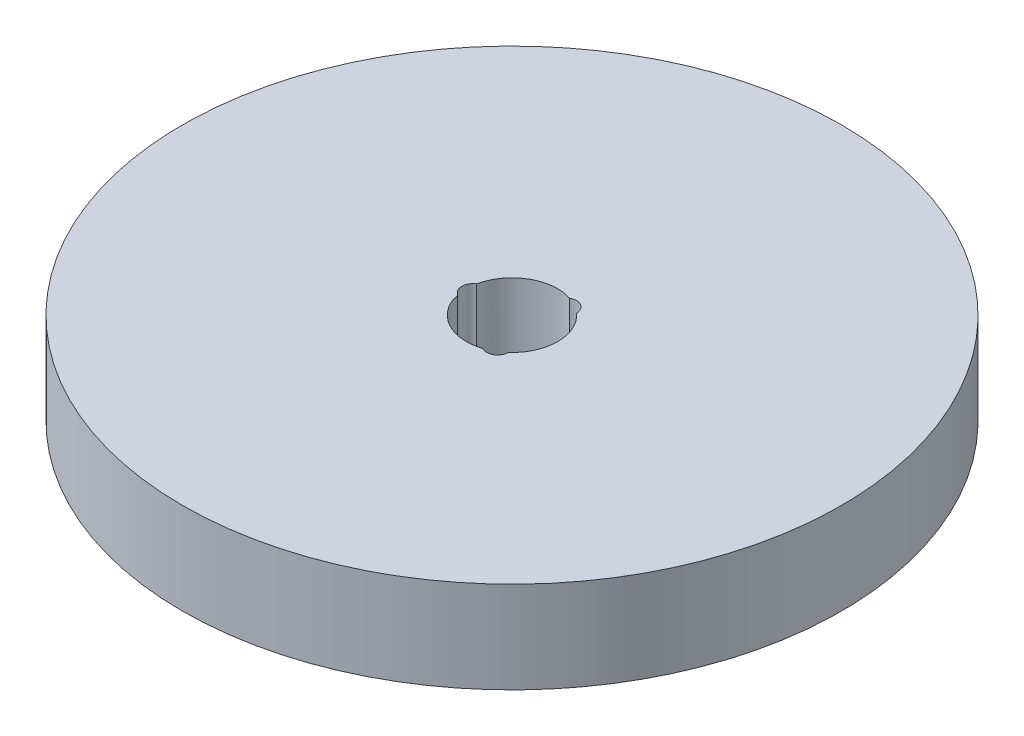
ISO-10303-21;
HEADER;
FILE_DESCRIPTION(('STEP AP214'),'2;1');
FILE_NAME('part.step','',(''),(''),'','','');
FILE_SCHEMA(('AUTOMOTIVE_DESIGN { 1 0 10303 214 1 1 1 1 }'));
ENDSEC;
DATA;
#1=APPLICATION_CONTEXT('core data for automotive mechanical design processes');
#2=APPLICATION_PROTOCOL_DEFINITION('international standard','automotive_design',2000,#1);
#3=PRODUCT_CONTEXT('',#1,'mechanical');
#4=PRODUCT('Part','Part','',(#3));
#5=PRODUCT_RELATED_PRODUCT_CATEGORY('part','',(#4));
#6=PRODUCT_DEFINITION_FORMATION('','',#4);
#7=PRODUCT_DEFINITION_CONTEXT('part definition',#1,'design');
#8=PRODUCT_DEFINITION('design','',#6,#7);
#9=PRODUCT_DEFINITION_SHAPE('','',#8);
#10=(LENGTH_UNIT() NAMED_UNIT(*) SI_UNIT(.MILLI.,.METRE.));
#11=(NAMED_UNIT(*) PLANE_ANGLE_UNIT() SI_UNIT($,.RADIAN.));
#12=(NAMED_UNIT(*) SI_UNIT($,.STERADIAN.) SOLID_ANGLE_UNIT());
#13=UNCERTAINTY_MEASURE_WITH_UNIT(LENGTH_MEASURE(1.E-05),#10,'distance_accuracy_value','');
#14=(GEOMETRIC_REPRESENTATION_CONTEXT(3) GLOBAL_UNCERTAINTY_ASSIGNED_CONTEXT((#13)) GLOBAL_UNIT_ASSIGNED_CONTEXT((#10,
#11,#12)) REPRESENTATION_CONTEXT('',''));
#15=CARTESIAN_POINT('',(0.,0.,0.));
#16=DIRECTION('',(0.,0.,1.));
#17=DIRECTION('',(1.,0.,0.));
#18=AXIS2_PLACEMENT_3D('',#15,#16,#17);
#19=CARTESIAN_POINT('',(0.,25.,0.));
#20=DIRECTION('',(0.,-1.,0.));
#21=DIRECTION('',(0.,0.,-1.));
#22=AXIS2_PLACEMENT_3D('',#19,#20,#21);
#23=CYLINDRICAL_SURFACE('',#22,90.);
#24=CARTESIAN_POINT('',(0.,25.,0.));
#25=DIRECTION('',(0.,1.,0.));
#26=DIRECTION('',(0.,0.,1.));
#27=AXIS2_PLACEMENT_3D('',#24,#25,#26);
#28=CIRCLE('',#27,90.);
#29=CARTESIAN_POINT('',(0.,25.,90.));
#30=VERTEX_POINT('',#29);
#31=EDGE_CURVE('E130',#30,#30,#28,.T.);
#32=ORIENTED_EDGE('',*,*,#31,.F.);
#33=EDGE_LOOP('',(#32));
#34=FACE_BOUND('',#33,.T.);
#35=CARTESIAN_POINT('',(0.,0.,0.));
#36=DIRECTION('',(0.,1.,0.));
#37=DIRECTION('',(0.,0.,1.));
#38=AXIS2_PLACEMENT_3D('',#35,#36,#37);
#39=CIRCLE('',#38,90.);
#40=CARTESIAN_POINT('',(0.,0.,90.));
#41=VERTEX_POINT('',#40);
#42=EDGE_CURVE('E117',#41,#41,#39,.T.);
#43=ORIENTED_EDGE('',*,*,#42,.T.);
#44=EDGE_LOOP('',(#43));
#45=FACE_BOUND('',#44,.T.);
#46=ADVANCED_FACE('F39',(#34,#45),#23,.T.);
#47=CARTESIAN_POINT('',(0.,25.,0.));
#48=DIRECTION('',(0.,1.,0.));
#49=DIRECTION('',(0.,0.,1.));
#50=AXIS2_PLACEMENT_3D('',#47,#48,#49);
#51=PLANE('',#50);
#52=CARTESIAN_POINT('',(5.32564066163358,25.,9.22428020880399));
#53=DIRECTION('',(0.,1.,0.));
#54=DIRECTION('',(0.866025403784436,0.,-0.500000000000004));
#55=AXIS2_PLACEMENT_3D('',#52,#53,#54);
#56=CIRCLE('',#55,3.03611618113724);
#57=CARTESIAN_POINT('',(3.86672240554045,25.,11.8869027857761));
#58=VERTEX_POINT('',#57);
#59=CARTESIAN_POINT('',(8.36099858202797,25.,9.29213122546848));
#60=VERTEX_POINT('',#59);
#61=EDGE_CURVE('E148',#58,#60,#56,.T.);
#62=ORIENTED_EDGE('',*,*,#61,.F.);
#63=CARTESIAN_POINT('',(0.,25.,0.));
#64=DIRECTION('',(0.,1.,0.));
#65=DIRECTION('',(0.,0.,1.));
#66=AXIS2_PLACEMENT_3D('',#63,#64,#65);
#67=CIRCLE('',#66,12.5);
#68=CARTESIAN_POINT('',(-12.2277209875683,25.,2.5947715603076));
#69=VERTEX_POINT('',#68);
#70=EDGE_CURVE('E113',#69,#58,#67,.T.);
#71=ORIENTED_EDGE('',*,*,#70,.F.);
#72=CARTESIAN_POINT('',(-10.6512813232671,25.,0.));
#73=DIRECTION('',(0.,1.,0.));
#74=DIRECTION('',(0.,0.,1.));
#75=AXIS2_PLACEMENT_3D('',#72,#73,#74);
#76=CIRCLE('',#75,3.03611618113724);
#77=CARTESIAN_POINT('',(-12.2277209875683,25.,-2.5947715603076));
#78=VERTEX_POINT('',#77);
#79=EDGE_CURVE('E125',#78,#69,#76,.T.);
#80=ORIENTED_EDGE('',*,*,#79,.F.);
#81=CARTESIAN_POINT('',(3.86672240554029,25.,-11.8869027857761));
#82=VERTEX_POINT('',#81);
#83=EDGE_CURVE('E107',#82,#78,#67,.T.);
#84=ORIENTED_EDGE('',*,*,#83,.F.);
#85=CARTESIAN_POINT('',(5.32564066163345,25.,-9.22428020880406));
#86=DIRECTION('',(0.,1.,0.));
#87=DIRECTION('',(-0.866025403784443,0.,-0.499999999999992));
#88=AXIS2_PLACEMENT_3D('',#85,#86,#87);
#89=CIRCLE('',#88,3.03611618113724);
#90=CARTESIAN_POINT('',(8.36099858202784,25.,-9.29213122546859));
#91=VERTEX_POINT('',#90);
#92=EDGE_CURVE('E95',#91,#82,#89,.T.);
#93=ORIENTED_EDGE('',*,*,#92,.F.);
#94=EDGE_CURVE('E106',#60,#91,#67,.T.);
#95=ORIENTED_EDGE('',*,*,#94,.F.);
#96=EDGE_LOOP('',(#62,#71,#80,#84,#93,#95));
#97=FACE_BOUND('',#96,.T.);
#98=ORIENTED_EDGE('',*,*,#31,.T.);
#99=EDGE_LOOP('',(#98));
#100=FACE_BOUND('',#99,.T.);
#101=ADVANCED_FACE('F102',(#97,#100),#51,.T.);
#102=CARTESIAN_POINT('',(0.,0.,0.));
#103=DIRECTION('',(0.,1.,0.));
#104=DIRECTION('',(0.,0.,1.));
#105=AXIS2_PLACEMENT_3D('',#102,#103,#104);
#106=PLANE('',#105);
#107=CARTESIAN_POINT('',(0.,0.,0.));
#108=DIRECTION('',(0.,1.,0.));
#109=DIRECTION('',(0.,0.,1.));
#110=AXIS2_PLACEMENT_3D('',#107,#108,#109);
#111=CIRCLE('',#110,12.5);
#112=CARTESIAN_POINT('',(0.,0.,12.5));
#113=VERTEX_POINT('',#112);
#114=EDGE_CURVE('E118',#113,#113,#111,.T.);
#115=ORIENTED_EDGE('',*,*,#114,.T.);
#116=EDGE_LOOP('',(#115));
#117=FACE_BOUND('',#116,.T.);
#118=ORIENTED_EDGE('',*,*,#42,.F.);
#119=EDGE_LOOP('',(#118));
#120=FACE_BOUND('',#119,.T.);
#121=ADVANCED_FACE('F161',(#117,#120),#106,.F.);
#122=CARTESIAN_POINT('',(0.,25.,0.));
#123=DIRECTION('',(0.,-1.,0.));
#124=DIRECTION('',(0.,0.,-1.));
#125=AXIS2_PLACEMENT_3D('',#122,#123,#124);
#126=CYLINDRICAL_SURFACE('',#125,12.5);
#127=DIRECTION('',(0.,1.,0.));
#128=VECTOR('',#127,1.);
#129=CARTESIAN_POINT('',(3.86672240554045,13.1831182027696,11.8869027857761));
#130=LINE('',#129,#128);
#131=CARTESIAN_POINT('',(3.86672240554045,1.36623640553924,11.8869027857761));
#132=VERTEX_POINT('',#131);
#133=EDGE_CURVE('E11',#132,#58,#130,.T.);
#134=ORIENTED_EDGE('',*,*,#133,.F.);
#135=CARTESIAN_POINT('',(0.,1.36623640553924,0.));
#136=DIRECTION('',(0.,1.,0.));
#137=DIRECTION('',(0.,0.,1.));
#138=AXIS2_PLACEMENT_3D('',#135,#136,#137);
#139=CIRCLE('',#138,12.5);
#140=CARTESIAN_POINT('',(8.36099858202797,1.36623640553924,9.29213122546848));
#141=VERTEX_POINT('',#140);
#142=EDGE_CURVE('E100',#132,#141,#139,.T.);
#143=ORIENTED_EDGE('',*,*,#142,.T.);
#144=DIRECTION('',(0.,1.,0.));
#145=VECTOR('',#144,1.);
#146=CARTESIAN_POINT('',(8.36099858202797,13.1831182027696,9.29213122546847));
#147=LINE('',#146,#145);
#148=EDGE_CURVE('E46',#60,#141,#147,.F.);
#149=ORIENTED_EDGE('',*,*,#148,.F.);
#150=ORIENTED_EDGE('',*,*,#94,.T.);
#151=DIRECTION('',(0.,1.,0.));
#152=VECTOR('',#151,1.);
#153=CARTESIAN_POINT('',(8.36099858202784,13.1831182027696,-9.29213122546859));
#154=LINE('',#153,#152);
#155=CARTESIAN_POINT('',(8.36099858202784,1.36623640553924,-9.29213122546859));
#156=VERTEX_POINT('',#155);
#157=EDGE_CURVE('E90',#156,#91,#154,.T.);
#158=ORIENTED_EDGE('',*,*,#157,.F.);
#159=CARTESIAN_POINT('',(0.,1.36623640553924,0.));
#160=DIRECTION('',(0.,1.,0.));
#161=DIRECTION('',(0.,0.,1.));
#162=AXIS2_PLACEMENT_3D('',#159,#160,#161);
#163=CIRCLE('',#162,12.5);
#164=CARTESIAN_POINT('',(3.86672240554029,1.36623640553924,-11.8869027857761));
#165=VERTEX_POINT('',#164);
#166=EDGE_CURVE('E143',#156,#165,#163,.T.);
#167=ORIENTED_EDGE('',*,*,#166,.T.);
#168=DIRECTION('',(0.,1.,0.));
#169=VECTOR('',#168,1.);
#170=CARTESIAN_POINT('',(3.86672240554028,13.1831182027696,-11.8869027857761));
#171=LINE('',#170,#169);
#172=EDGE_CURVE('E98',#82,#165,#171,.F.);
#173=ORIENTED_EDGE('',*,*,#172,.F.);
#174=ORIENTED_EDGE('',*,*,#83,.T.);
#175=DIRECTION('',(0.,1.,0.));
#176=VECTOR('',#175,1.);
#177=CARTESIAN_POINT('',(-12.2277209875683,13.1831182027696,-2.5947715603076));
#178=LINE('',#177,#176);
#179=CARTESIAN_POINT('',(-12.2277209875683,1.36623640553924,-2.5947715603076));
#180=VERTEX_POINT('',#179);
#181=EDGE_CURVE('E137',#180,#78,#178,.T.);
#182=ORIENTED_EDGE('',*,*,#181,.F.);
#183=CARTESIAN_POINT('',(0.,1.36623640553924,0.));
#184=DIRECTION('',(0.,1.,0.));
#185=DIRECTION('',(0.,0.,1.));
#186=AXIS2_PLACEMENT_3D('',#183,#184,#185);
#187=CIRCLE('',#186,12.5);
#188=CARTESIAN_POINT('',(-12.2277209875683,1.36623640553924,2.5947715603076));
#189=VERTEX_POINT('',#188);
#190=EDGE_CURVE('E128',#180,#189,#187,.T.);
#191=ORIENTED_EDGE('',*,*,#190,.T.);
#192=DIRECTION('',(0.,1.,0.));
#193=VECTOR('',#192,1.);
#194=CARTESIAN_POINT('',(-12.2277209875683,13.1831182027696,2.5947715603076));
#195=LINE('',#194,#193);
#196=EDGE_CURVE('E134',#69,#189,#195,.F.);
#197=ORIENTED_EDGE('',*,*,#196,.F.);
#198=ORIENTED_EDGE('',*,*,#70,.T.);
#199=EDGE_LOOP('',(#134,#143,#149,#150,#158,#167,#173,#174,#182,#191,#197,#198));
#200=FACE_BOUND('',#199,.T.);
#201=ORIENTED_EDGE('',*,*,#114,.F.);
#202=EDGE_LOOP('',(#201));
#203=FACE_BOUND('',#202,.T.);
#204=ADVANCED_FACE('F115',(#200,#203),#126,.F.);
#205=CARTESIAN_POINT('',(-10.6512813232671,1.36623640553924,0.));
#206=DIRECTION('',(0.,1.,0.));
#207=DIRECTION('',(0.,0.,1.));
#208=AXIS2_PLACEMENT_3D('',#205,#206,#207);
#209=CYLINDRICAL_SURFACE('',#208,3.03611618113724);
#210=ORIENTED_EDGE('',*,*,#181,.T.);
#211=ORIENTED_EDGE('',*,*,#79,.T.);
#212=ORIENTED_EDGE('',*,*,#196,.T.);
#213=CARTESIAN_POINT('',(-10.6512813232671,1.36623640553924,0.));
#214=DIRECTION('',(0.,1.,0.));
#215=DIRECTION('',(0.,0.,1.));
#216=AXIS2_PLACEMENT_3D('',#213,#214,#215);
#217=CIRCLE('',#216,3.03611618113724);
#218=EDGE_CURVE('E127',#180,#189,#217,.T.);
#219=ORIENTED_EDGE('',*,*,#218,.F.);
#220=EDGE_LOOP('',(#210,#211,#212,#219));
#221=FACE_BOUND('',#220,.T.);
#222=ADVANCED_FACE('F175',(#221),#209,.F.);
#223=CARTESIAN_POINT('',(-10.6512813232671,1.36623640553924,0.));
#224=DIRECTION('',(0.,1.,0.));
#225=DIRECTION('',(0.,0.,1.));
#226=AXIS2_PLACEMENT_3D('',#223,#224,#225);
#227=PLANE('',#226);
#228=ORIENTED_EDGE('',*,*,#218,.T.);
#229=ORIENTED_EDGE('',*,*,#190,.F.);
#230=EDGE_LOOP('',(#228,#229));
#231=FACE_BOUND('',#230,.T.);
#232=ADVANCED_FACE('F176',(#231),#227,.T.);
#233=CARTESIAN_POINT('',(5.32564066163345,1.36623640553924,-9.22428020880406));
#234=DIRECTION('',(0.,1.,0.));
#235=DIRECTION('',(0.,0.,1.));
#236=AXIS2_PLACEMENT_3D('',#233,#234,#235);
#237=CYLINDRICAL_SURFACE('',#236,3.03611618113724);
#238=ORIENTED_EDGE('',*,*,#157,.T.);
#239=ORIENTED_EDGE('',*,*,#92,.T.);
#240=ORIENTED_EDGE('',*,*,#172,.T.);
#241=CARTESIAN_POINT('',(5.32564066163345,1.36623640553924,-9.22428020880406));
#242=DIRECTION('',(0.,1.,0.));
#243=DIRECTION('',(-0.866025403784443,0.,-0.499999999999992));
#244=AXIS2_PLACEMENT_3D('',#241,#242,#243);
#245=CIRCLE('',#244,3.03611618113724);
#246=EDGE_CURVE('E56',#156,#165,#245,.T.);
#247=ORIENTED_EDGE('',*,*,#246,.F.);
#248=EDGE_LOOP('',(#238,#239,#240,#247));
#249=FACE_BOUND('',#248,.T.);
#250=ADVANCED_FACE('F93',(#249),#237,.F.);
#251=CARTESIAN_POINT('',(5.32564066163345,1.36623640553924,-9.22428020880406));
#252=DIRECTION('',(0.,1.,0.));
#253=DIRECTION('',(-0.866025403784443,0.,-0.499999999999992));
#254=AXIS2_PLACEMENT_3D('',#251,#252,#253);
#255=PLANE('',#254);
#256=ORIENTED_EDGE('',*,*,#246,.T.);
#257=ORIENTED_EDGE('',*,*,#166,.F.);
#258=EDGE_LOOP('',(#256,#257));
#259=FACE_BOUND('',#258,.T.);
#260=ADVANCED_FACE('F153',(#259),#255,.T.);
#261=CARTESIAN_POINT('',(5.32564066163358,1.36623640553924,9.22428020880399));
#262=DIRECTION('',(0.,1.,0.));
#263=DIRECTION('',(0.,0.,1.));
#264=AXIS2_PLACEMENT_3D('',#261,#262,#263);
#265=CYLINDRICAL_SURFACE('',#264,3.03611618113724);
#266=ORIENTED_EDGE('',*,*,#133,.T.);
#267=ORIENTED_EDGE('',*,*,#61,.T.);
#268=ORIENTED_EDGE('',*,*,#148,.T.);
#269=CARTESIAN_POINT('',(5.32564066163358,1.36623640553924,9.22428020880399));
#270=DIRECTION('',(0.,1.,0.));
#271=DIRECTION('',(0.866025403784436,0.,-0.500000000000004));
#272=AXIS2_PLACEMENT_3D('',#269,#270,#271);
#273=CIRCLE('',#272,3.03611618113724);
#274=EDGE_CURVE('E55',#132,#141,#273,.T.);
#275=ORIENTED_EDGE('',*,*,#274,.F.);
#276=EDGE_LOOP('',(#266,#267,#268,#275));
#277=FACE_BOUND('',#276,.T.);
#278=ADVANCED_FACE('F144',(#277),#265,.F.);
#279=CARTESIAN_POINT('',(5.32564066163358,1.36623640553924,9.22428020880399));
#280=DIRECTION('',(0.,1.,0.));
#281=DIRECTION('',(0.866025403784436,0.,-0.500000000000004));
#282=AXIS2_PLACEMENT_3D('',#279,#280,#281);
#283=PLANE('',#282);
#284=ORIENTED_EDGE('',*,*,#274,.T.);
#285=ORIENTED_EDGE('',*,*,#142,.F.);
#286=EDGE_LOOP('',(#284,#285));
#287=FACE_BOUND('',#286,.T.);
#288=ADVANCED_FACE('F150',(#287),#283,.T.);
#289=CLOSED_SHELL('',(#46,#101,#121,#204,#222,#232,#250,#260,#278,#288));
#290=MANIFOLD_SOLID_BREP('B2',#289);
#291=ADVANCED_BREP_SHAPE_REPRESENTATION('',(#18,#290),#14);
#292=SHAPE_DEFINITION_REPRESENTATION(#9,#291);
ENDSEC;
END-ISO-10303-21;
